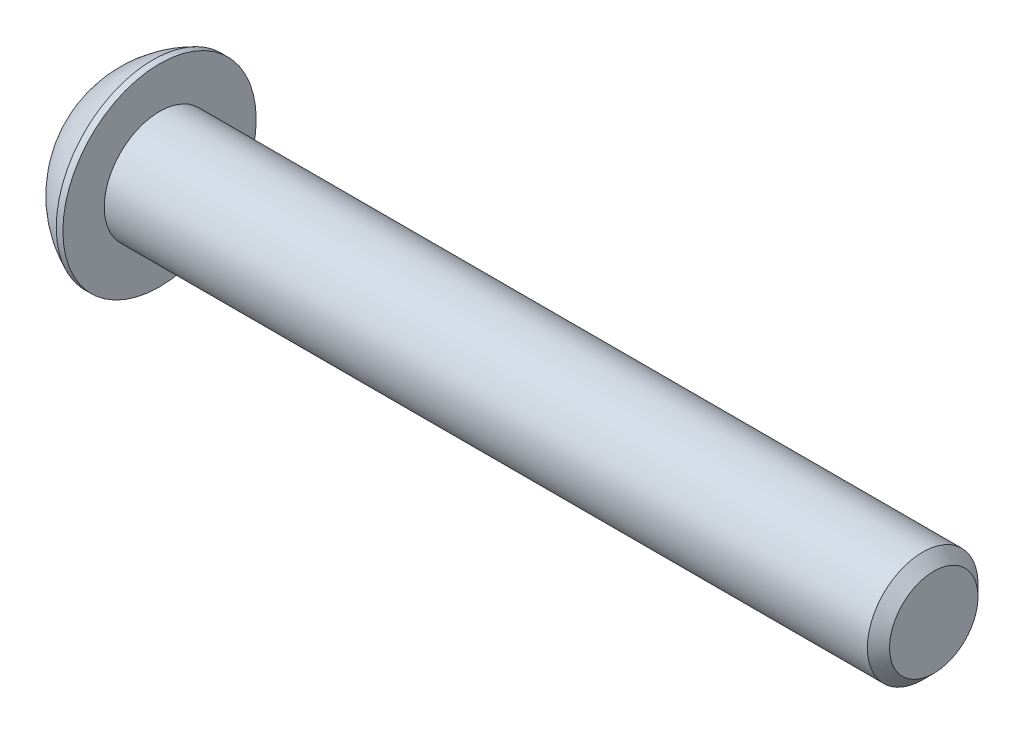
ISO-10303-21;
HEADER;
FILE_DESCRIPTION(('STEP AP214'),'2;1');
FILE_NAME('part.step','',(''),(''),'','','');
FILE_SCHEMA(('AUTOMOTIVE_DESIGN { 1 0 10303 214 1 1 1 1 }'));
ENDSEC;
DATA;
#1=APPLICATION_CONTEXT('core data for automotive mechanical design processes');
#2=APPLICATION_PROTOCOL_DEFINITION('international standard','automotive_design',2000,#1);
#3=PRODUCT_CONTEXT('',#1,'mechanical');
#4=PRODUCT('Part','Part','',(#3));
#5=PRODUCT_RELATED_PRODUCT_CATEGORY('part','',(#4));
#6=PRODUCT_DEFINITION_FORMATION('','',#4);
#7=PRODUCT_DEFINITION_CONTEXT('part definition',#1,'design');
#8=PRODUCT_DEFINITION('design','',#6,#7);
#9=PRODUCT_DEFINITION_SHAPE('','',#8);
#10=(LENGTH_UNIT() NAMED_UNIT(*) SI_UNIT(.MILLI.,.METRE.));
#11=(NAMED_UNIT(*) PLANE_ANGLE_UNIT() SI_UNIT($,.RADIAN.));
#12=(NAMED_UNIT(*) SI_UNIT($,.STERADIAN.) SOLID_ANGLE_UNIT());
#13=UNCERTAINTY_MEASURE_WITH_UNIT(LENGTH_MEASURE(1.E-05),#10,'distance_accuracy_value','');
#14=(GEOMETRIC_REPRESENTATION_CONTEXT(3) GLOBAL_UNCERTAINTY_ASSIGNED_CONTEXT((#13)) GLOBAL_UNIT_ASSIGNED_CONTEXT((#10,
#11,#12)) REPRESENTATION_CONTEXT('',''));
#15=CARTESIAN_POINT('',(0.,0.,0.));
#16=DIRECTION('',(0.,0.,1.));
#17=DIRECTION('',(1.,0.,0.));
#18=AXIS2_PLACEMENT_3D('',#15,#16,#17);
#19=CARTESIAN_POINT('',(1.32080000000045,0.,0.));
#20=DIRECTION('',(-1.,0.,0.));
#21=DIRECTION('',(0.,0.,1.));
#22=AXIS2_PLACEMENT_3D('',#19,#20,#21);
#23=CONICAL_SURFACE('',#22,1.1937999999998,1.04719755119615);
#24=CARTESIAN_POINT('',(2.01004075135902,0.,-4.44089209850063E-13));
#25=VERTEX_POINT('',#24);
#26=VERTEX_LOOP('',#25);
#27=FACE_BOUND('',#26,.T.);
#28=CARTESIAN_POINT('',(1.32080000000033,0.,0.));
#29=DIRECTION('',(-1.,0.,0.));
#30=DIRECTION('',(0.,0.,1.));
#31=AXIS2_PLACEMENT_3D('',#28,#29,#30);
#32=CIRCLE('',#31,1.19380000000002);
#33=CARTESIAN_POINT('',(1.32080000000033,0.,1.19380000000002));
#34=VERTEX_POINT('',#33);
#35=EDGE_CURVE('E20',#34,#34,#32,.T.);
#36=ORIENTED_EDGE('',*,*,#35,.T.);
#37=EDGE_LOOP('',(#36));
#38=FACE_BOUND('',#37,.T.);
#39=ADVANCED_FACE('F17',(#27,#38),#23,.F.);
#40=CARTESIAN_POINT('',(1.32080000000001,-2.29135888084632,0.));
#41=DIRECTION('',(1.,0.,0.));
#42=DIRECTION('',(0.,1.,0.));
#43=AXIS2_PLACEMENT_3D('',#40,#41,#42);
#44=PLANE('',#43);
#45=DIRECTION('',(0.,1.,0.));
#46=VECTOR('',#45,1.);
#47=CARTESIAN_POINT('',(1.32080000000001,-1.14567944042309,1.98437500000009));
#48=LINE('',#47,#46);
#49=CARTESIAN_POINT('',(1.32080000000001,1.14567944042324,1.98437500000009));
#50=VERTEX_POINT('',#49);
#51=CARTESIAN_POINT('',(1.32080000000001,-1.14567944042309,1.98437500000009));
#52=VERTEX_POINT('',#51);
#53=EDGE_CURVE('E69',#50,#52,#48,.F.);
#54=ORIENTED_EDGE('',*,*,#53,.F.);
#55=DIRECTION('',(0.,0.5,-0.866025403784439));
#56=VECTOR('',#55,1.);
#57=CARTESIAN_POINT('',(1.32080000000001,1.14567944042324,1.98437500000009));
#58=LINE('',#57,#56);
#59=CARTESIAN_POINT('',(1.32080000000001,2.29135888084636,0.));
#60=VERTEX_POINT('',#59);
#61=EDGE_CURVE('E190',#60,#50,#58,.F.);
#62=ORIENTED_EDGE('',*,*,#61,.F.);
#63=DIRECTION('',(0.,-0.500000000000003,-0.866025403784437));
#64=VECTOR('',#63,1.);
#65=CARTESIAN_POINT('',(1.32080000000001,2.29135888084635,0.));
#66=LINE('',#65,#64);
#67=CARTESIAN_POINT('',(1.32080000000001,1.14567944042318,-1.98437499999994));
#68=VERTEX_POINT('',#67);
#69=EDGE_CURVE('E194',#68,#60,#66,.F.);
#70=ORIENTED_EDGE('',*,*,#69,.F.);
#71=DIRECTION('',(0.,-1.,0.));
#72=VECTOR('',#71,1.);
#73=CARTESIAN_POINT('',(1.32080000000001,1.14567944042318,-1.98437499999994));
#74=LINE('',#73,#72);
#75=CARTESIAN_POINT('',(1.32080000000001,-1.14567944042316,-1.98437499999991));
#76=VERTEX_POINT('',#75);
#77=EDGE_CURVE('E199',#76,#68,#74,.F.);
#78=ORIENTED_EDGE('',*,*,#77,.F.);
#79=DIRECTION('',(0.,-0.500000000000001,0.866025403784438));
#80=VECTOR('',#79,1.);
#81=CARTESIAN_POINT('',(1.32080000000001,-1.14567944042317,-1.9843749999999));
#82=LINE('',#81,#80);
#83=CARTESIAN_POINT('',(1.32080000000001,-2.29135888084632,0.));
#84=VERTEX_POINT('',#83);
#85=EDGE_CURVE('E204',#84,#76,#82,.F.);
#86=ORIENTED_EDGE('',*,*,#85,.F.);
#87=DIRECTION('',(0.,0.500000000000003,0.866025403784437));
#88=VECTOR('',#87,1.);
#89=CARTESIAN_POINT('',(1.32080000000001,-2.29135888084632,0.));
#90=LINE('',#89,#88);
#91=EDGE_CURVE('E82',#52,#84,#90,.F.);
#92=ORIENTED_EDGE('',*,*,#91,.F.);
#93=EDGE_LOOP('',(#54,#62,#70,#78,#86,#92));
#94=FACE_BOUND('',#93,.T.);
#95=ORIENTED_EDGE('',*,*,#35,.F.);
#96=EDGE_LOOP('',(#95));
#97=FACE_BOUND('',#96,.T.);
#98=ADVANCED_FACE('F75',(#94,#97),#44,.F.);
#99=CARTESIAN_POINT('',(1.32080000000001,-1.14567944042309,1.98437500000009));
#100=DIRECTION('',(0.,0.,-1.));
#101=DIRECTION('',(0.,1.,0.));
#102=AXIS2_PLACEMENT_3D('',#99,#100,#101);
#103=PLANE('',#102);
#104=ORIENTED_EDGE('',*,*,#53,.T.);
#105=DIRECTION('',(1.,0.,0.));
#106=VECTOR('',#105,1.);
#107=CARTESIAN_POINT('',(1.32080000000001,-1.14567944042311,1.98437500000011));
#108=LINE('',#107,#106);
#109=CARTESIAN_POINT('',(0.,-1.14567944042309,1.98437500000009));
#110=VERTEX_POINT('',#109);
#111=EDGE_CURVE('E79',#110,#52,#108,.T.);
#112=ORIENTED_EDGE('',*,*,#111,.F.);
#113=DIRECTION('',(0.,-1.,0.));
#114=VECTOR('',#113,1.);
#115=CARTESIAN_POINT('',(0.,0.,1.98437500000009));
#116=LINE('',#115,#114);
#117=CARTESIAN_POINT('',(0.,1.14567944042324,1.98437500000009));
#118=VERTEX_POINT('',#117);
#119=EDGE_CURVE('E184',#118,#110,#116,.T.);
#120=ORIENTED_EDGE('',*,*,#119,.F.);
#121=DIRECTION('',(1.,0.,0.));
#122=VECTOR('',#121,1.);
#123=CARTESIAN_POINT('',(1.32080000000001,1.14567944042324,1.98437500000009));
#124=LINE('',#123,#122);
#125=EDGE_CURVE('E187',#50,#118,#124,.F.);
#126=ORIENTED_EDGE('',*,*,#125,.F.);
#127=EDGE_LOOP('',(#104,#112,#120,#126));
#128=FACE_BOUND('',#127,.T.);
#129=ADVANCED_FACE('F129',(#128),#103,.T.);
#130=CARTESIAN_POINT('',(1.32080000000001,-2.29135888084632,0.));
#131=DIRECTION('',(0.,0.866025403784437,-0.500000000000003));
#132=DIRECTION('',(0.,0.500000000000003,0.866025403784437));
#133=AXIS2_PLACEMENT_3D('',#130,#131,#132);
#134=PLANE('',#133);
#135=ORIENTED_EDGE('',*,*,#91,.T.);
#136=DIRECTION('',(1.,0.,0.));
#137=VECTOR('',#136,1.);
#138=CARTESIAN_POINT('',(1.32080000000001,-2.29135888084631,0.));
#139=LINE('',#138,#137);
#140=CARTESIAN_POINT('',(0.,-2.29135888084632,0.));
#141=VERTEX_POINT('',#140);
#142=EDGE_CURVE('E206',#141,#84,#139,.T.);
#143=ORIENTED_EDGE('',*,*,#142,.F.);
#144=DIRECTION('',(0.,-0.500000000000024,-0.866025403784425));
#145=VECTOR('',#144,1.);
#146=CARTESIAN_POINT('',(0.,-1.14567944042307,1.98437500000008));
#147=LINE('',#146,#145);
#148=EDGE_CURVE('E181',#110,#141,#147,.T.);
#149=ORIENTED_EDGE('',*,*,#148,.F.);
#150=ORIENTED_EDGE('',*,*,#111,.T.);
#151=EDGE_LOOP('',(#135,#143,#149,#150));
#152=FACE_BOUND('',#151,.T.);
#153=ADVANCED_FACE('F125',(#152),#134,.T.);
#154=CARTESIAN_POINT('',(1.32080000000001,-1.14567944042317,-1.9843749999999));
#155=DIRECTION('',(0.,0.866025403784438,0.500000000000001));
#156=DIRECTION('',(0.,-0.500000000000001,0.866025403784438));
#157=AXIS2_PLACEMENT_3D('',#154,#155,#156);
#158=PLANE('',#157);
#159=ORIENTED_EDGE('',*,*,#85,.T.);
#160=DIRECTION('',(1.,0.,0.));
#161=VECTOR('',#160,1.);
#162=CARTESIAN_POINT('',(1.32080000000001,-1.14567944042315,-1.98437499999994));
#163=LINE('',#162,#161);
#164=CARTESIAN_POINT('',(0.,-1.14567944042316,-1.98437499999992));
#165=VERTEX_POINT('',#164);
#166=EDGE_CURVE('E201',#165,#76,#163,.T.);
#167=ORIENTED_EDGE('',*,*,#166,.F.);
#168=DIRECTION('',(0.,0.500000000000004,-0.866025403784436));
#169=VECTOR('',#168,1.);
#170=CARTESIAN_POINT('',(0.,-2.29135888084632,0.));
#171=LINE('',#170,#169);
#172=EDGE_CURVE('E178',#141,#165,#171,.T.);
#173=ORIENTED_EDGE('',*,*,#172,.F.);
#174=ORIENTED_EDGE('',*,*,#142,.T.);
#175=EDGE_LOOP('',(#159,#167,#173,#174));
#176=FACE_BOUND('',#175,.T.);
#177=ADVANCED_FACE('F121',(#176),#158,.T.);
#178=CARTESIAN_POINT('',(1.32080000000001,1.14567944042318,-1.98437499999994));
#179=DIRECTION('',(0.,0.,1.));
#180=DIRECTION('',(0.,-1.,0.));
#181=AXIS2_PLACEMENT_3D('',#178,#179,#180);
#182=PLANE('',#181);
#183=ORIENTED_EDGE('',*,*,#77,.T.);
#184=DIRECTION('',(1.,0.,0.));
#185=VECTOR('',#184,1.);
#186=CARTESIAN_POINT('',(1.32080000000001,1.14567944042317,-1.984375));
#187=LINE('',#186,#185);
#188=CARTESIAN_POINT('',(0.,1.14567944042318,-1.98437499999995));
#189=VERTEX_POINT('',#188);
#190=EDGE_CURVE('E196',#189,#68,#187,.T.);
#191=ORIENTED_EDGE('',*,*,#190,.F.);
#192=DIRECTION('',(0.,-1.,0.));
#193=VECTOR('',#192,1.);
#194=CARTESIAN_POINT('',(0.,0.,-1.98437499999993));
#195=LINE('',#194,#193);
#196=EDGE_CURVE('E175',#165,#189,#195,.F.);
#197=ORIENTED_EDGE('',*,*,#196,.F.);
#198=ORIENTED_EDGE('',*,*,#166,.T.);
#199=EDGE_LOOP('',(#183,#191,#197,#198));
#200=FACE_BOUND('',#199,.T.);
#201=ADVANCED_FACE('F118',(#200),#182,.T.);
#202=CARTESIAN_POINT('',(1.32080000000001,2.29135888084635,0.));
#203=DIRECTION('',(0.,-0.866025403784437,0.500000000000003));
#204=DIRECTION('',(0.,-0.500000000000003,-0.866025403784437));
#205=AXIS2_PLACEMENT_3D('',#202,#203,#204);
#206=PLANE('',#205);
#207=ORIENTED_EDGE('',*,*,#69,.T.);
#208=DIRECTION('',(1.,0.,0.));
#209=VECTOR('',#208,1.);
#210=CARTESIAN_POINT('',(1.32080000000001,2.29135888084642,0.));
#211=LINE('',#210,#209);
#212=CARTESIAN_POINT('',(0.,2.29135888084636,0.));
#213=VERTEX_POINT('',#212);
#214=EDGE_CURVE('E35',#213,#60,#211,.T.);
#215=ORIENTED_EDGE('',*,*,#214,.F.);
#216=DIRECTION('',(0.,0.500000000000003,0.866025403784437));
#217=VECTOR('',#216,1.);
#218=CARTESIAN_POINT('',(0.,1.14567944042317,-1.984375));
#219=LINE('',#218,#217);
#220=EDGE_CURVE('E172',#189,#213,#219,.T.);
#221=ORIENTED_EDGE('',*,*,#220,.F.);
#222=ORIENTED_EDGE('',*,*,#190,.T.);
#223=EDGE_LOOP('',(#207,#215,#221,#222));
#224=FACE_BOUND('',#223,.T.);
#225=ADVANCED_FACE('F114',(#224),#206,.T.);
#226=CARTESIAN_POINT('',(1.32080000000001,1.14567944042324,1.98437500000009));
#227=DIRECTION('',(0.,-0.866025403784439,-0.5));
#228=DIRECTION('',(0.,0.5,-0.866025403784439));
#229=AXIS2_PLACEMENT_3D('',#226,#227,#228);
#230=PLANE('',#229);
#231=ORIENTED_EDGE('',*,*,#61,.T.);
#232=ORIENTED_EDGE('',*,*,#125,.T.);
#233=DIRECTION('',(0.,-0.499999999999968,0.866025403784457));
#234=VECTOR('',#233,1.);
#235=CARTESIAN_POINT('',(0.,2.29135888084635,0.));
#236=LINE('',#235,#234);
#237=EDGE_CURVE('E101',#213,#118,#236,.T.);
#238=ORIENTED_EDGE('',*,*,#237,.F.);
#239=ORIENTED_EDGE('',*,*,#214,.T.);
#240=EDGE_LOOP('',(#231,#232,#238,#239));
#241=FACE_BOUND('',#240,.T.);
#242=ADVANCED_FACE('F110',(#241),#230,.T.);
#243=CARTESIAN_POINT('',(0.,0.,0.));
#244=DIRECTION('',(-1.,0.,0.));
#245=DIRECTION('',(0.,-1.,0.));
#246=AXIS2_PLACEMENT_3D('',#243,#244,#245);
#247=PLANE('',#246);
#248=ORIENTED_EDGE('',*,*,#220,.T.);
#249=ORIENTED_EDGE('',*,*,#237,.T.);
#250=ORIENTED_EDGE('',*,*,#119,.T.);
#251=ORIENTED_EDGE('',*,*,#148,.T.);
#252=ORIENTED_EDGE('',*,*,#172,.T.);
#253=ORIENTED_EDGE('',*,*,#196,.T.);
#254=EDGE_LOOP('',(#248,#249,#250,#251,#252,#253));
#255=FACE_BOUND('',#254,.T.);
#256=CARTESIAN_POINT('',(0.,2.77495000000004,0.));
#257=CARTESIAN_POINT('',(0.,2.77494953309951,0.077911893752265));
#258=CARTESIAN_POINT('',(0.,2.77166578388029,0.155838105919689));
#259=CARTESIAN_POINT('',(0.,2.75855213600209,0.311152012455823));
#260=CARTESIAN_POINT('',(0.,2.74872030471471,0.388539541019475));
#261=CARTESIAN_POINT('',(0.,2.72255472645681,0.542341518735636));
#262=CARTESIAN_POINT('',(-2.70994793820671E-13,2.70621065843667,0.618754223567496));
#263=CARTESIAN_POINT('',(2.71215166270345E-13,2.66713326915781,0.769973634285941));
#264=CARTESIAN_POINT('',(1.01269126320733E-12,2.64439476297873,0.8447789836462));
#265=CARTESIAN_POINT('',(1.81921584447808E-12,2.56690195943355,1.06566239301784));
#266=CARTESIAN_POINT('',(4.76637279005743E-13,2.50280672569933,1.20857954243979));
#267=CARTESIAN_POINT('',(-4.76655399922673E-13,2.35149826934101,1.4816087456153));
#268=CARTESIAN_POINT('',(0.,2.264284167904,1.6117203123349));
#269=CARTESIAN_POINT('',(0.,2.11810939288344,1.79445660654259));
#270=CARTESIAN_POINT('',(0.,2.0667869379163,1.85333128513988));
#271=CARTESIAN_POINT('',(0.,1.95940522984453,1.96650727912783));
#272=CARTESIAN_POINT('',(0.,1.90335059143539,2.02081294920036));
#273=CARTESIAN_POINT('',(0.,1.78683891013966,2.12453280878573));
#274=CARTESIAN_POINT('',(0.,1.72637988450325,2.17394477135531));
#275=CARTESIAN_POINT('',(0.,1.60151968865714,2.26750481692899));
#276=CARTESIAN_POINT('',(0.,1.53711760864541,2.31165167810839));
#277=CARTESIAN_POINT('',(0.,1.33869902291635,2.43567242603936));
#278=CARTESIAN_POINT('',(0.,1.19934704110699,2.50723588662792));
#279=CARTESIAN_POINT('',(0.,0.910681609121916,2.62590828672813));
#280=CARTESIAN_POINT('',(0.,0.761368265357432,2.6730174874227));
#281=CARTESIAN_POINT('',(0.,0.456932649466656,2.74151230663998));
#282=CARTESIAN_POINT('',(0.,0.301810346322617,2.76289778778712));
#283=CARTESIAN_POINT('',(0.,-0.00982263870891821,2.77931595661147));
#284=CARTESIAN_POINT('',(0.,-0.166333320596415,2.77434864428868));
#285=CARTESIAN_POINT('',(0.,-0.476280836814418,2.73822217653064));
#286=CARTESIAN_POINT('',(0.,-0.629717687555952,2.70706316096972));
#287=CARTESIAN_POINT('',(0.,-0.929254830044241,2.6193798077114));
#288=CARTESIAN_POINT('',(0.,-1.07535504341316,2.56285519909559));
#289=CARTESIAN_POINT('',(0.,-1.28570692598576,2.46037024128099));
#290=CARTESIAN_POINT('',(0.,-1.35439130022283,2.42323494812886));
#291=CARTESIAN_POINT('',(0.,-1.48839128719896,2.34331277270246));
#292=CARTESIAN_POINT('',(0.,-1.55370767631784,2.30052720108822));
#293=CARTESIAN_POINT('',(0.,-1.68047292776591,2.20962421887045));
#294=CARTESIAN_POINT('',(0.,-1.74192352786817,2.16150923122339));
#295=CARTESIAN_POINT('',(0.,-1.86060297067988,2.06024311301273));
#296=CARTESIAN_POINT('',(0.,-1.91782768181712,2.00708716697621));
#297=CARTESIAN_POINT('',(0.,-2.08239462196648,1.84072208565531));
#298=CARTESIAN_POINT('',(0.,-2.18279764272598,1.72049499758412));
#299=CARTESIAN_POINT('',(0.,-2.3619575494406,1.46487629213008));
#300=CARTESIAN_POINT('',(0.,-2.44071525816753,1.32948525142797));
#301=CARTESIAN_POINT('',(0.,-2.5409888269527,1.11796734074385));
#302=CARTESIAN_POINT('',(0.,-2.57146177392723,1.04596540008337));
#303=CARTESIAN_POINT('',(0.,-2.62621251108995,0.899689259475667));
#304=CARTESIAN_POINT('',(0.,-2.6504953149556,0.825416953360854));
#305=CARTESIAN_POINT('',(0.,-2.69267708798763,0.675215808695108));
#306=CARTESIAN_POINT('',(0.,-2.71058613777933,0.599289789312993));
#307=CARTESIAN_POINT('',(0.,-2.73994710360123,0.446213628496834));
#308=CARTESIAN_POINT('',(0.,-2.75140092413867,0.36906385502469));
#309=CARTESIAN_POINT('',(0.,-2.76470470685519,0.243162088173333));
#310=CARTESIAN_POINT('',(0.,-2.76854547596614,0.194611672428479));
#311=CARTESIAN_POINT('',(0.,-2.7736682684326,0.0973760351838824));
#312=CARTESIAN_POINT('',(0.,-2.7749502917881,0.0486908136841404));
#313=CARTESIAN_POINT('',(0.,-2.77494953309943,-0.0779118937524467));
#314=CARTESIAN_POINT('',(0.,-2.77166578388021,-0.155838105919871));
#315=CARTESIAN_POINT('',(0.,-2.758552136002,-0.311152012456005));
#316=CARTESIAN_POINT('',(0.,-2.74872030471463,-0.388539541019658));
#317=CARTESIAN_POINT('',(0.,-2.72255472645672,-0.542341518735819));
#318=CARTESIAN_POINT('',(-2.70986635185437E-13,-2.70621065843658,-0.618754223567679));
#319=CARTESIAN_POINT('',(2.71207001000523E-13,-2.66713326915773,-0.769973634286124));
#320=CARTESIAN_POINT('',(1.01268841923123E-12,-2.64439476297865,-0.844778983646384));
#321=CARTESIAN_POINT('',(1.81922151887338E-12,-2.56690195943347,-1.06566239301802));
#322=CARTESIAN_POINT('',(4.7663876570586E-13,-2.50280672569924,-1.20857954243998));
#323=CARTESIAN_POINT('',(-4.76656886679312E-13,-2.35149826934092,-1.48160874561548));
#324=CARTESIAN_POINT('',(0.,-2.26428416790392,-1.61172031233509));
#325=CARTESIAN_POINT('',(0.,-2.11810939288336,-1.79445660654278));
#326=CARTESIAN_POINT('',(0.,-2.06678693791622,-1.85333128514006));
#327=CARTESIAN_POINT('',(0.,-1.95940522984444,-1.96650727912802));
#328=CARTESIAN_POINT('',(0.,-1.9033505914353,-2.02081294920054));
#329=CARTESIAN_POINT('',(0.,-1.78683891013958,-2.12453280878591));
#330=CARTESIAN_POINT('',(0.,-1.72637988450317,-2.1739447713555));
#331=CARTESIAN_POINT('',(0.,-1.60151968865706,-2.26750481692918));
#332=CARTESIAN_POINT('',(0.,-1.53711760864532,-2.31165167810857));
#333=CARTESIAN_POINT('',(0.,-1.33869902291627,-2.43567242603954));
#334=CARTESIAN_POINT('',(0.,-1.1993470411069,-2.5072358866281));
#335=CARTESIAN_POINT('',(0.,-0.910681609121828,-2.62590828672831));
#336=CARTESIAN_POINT('',(0.,-0.761368265357345,-2.67301748742288));
#337=CARTESIAN_POINT('',(0.,-0.45693264946657,-2.74151230664016));
#338=CARTESIAN_POINT('',(0.,-0.301810346322531,-2.7628977877873));
#339=CARTESIAN_POINT('',(0.,0.00982263870900505,-2.77931595661164));
#340=CARTESIAN_POINT('',(0.,0.166333320596502,-2.77434864428886));
#341=CARTESIAN_POINT('',(0.,0.476280836814504,-2.73822217653082));
#342=CARTESIAN_POINT('',(0.,0.629717687556037,-2.7070631609699));
#343=CARTESIAN_POINT('',(0.,0.929254830044326,-2.61937980771158));
#344=CARTESIAN_POINT('',(0.,1.07535504341325,-2.56285519909577));
#345=CARTESIAN_POINT('',(0.,1.28570692598584,-2.46037024128117));
#346=CARTESIAN_POINT('',(0.,1.35439130022292,-2.42323494812904));
#347=CARTESIAN_POINT('',(0.,1.48839128719905,-2.34331277270264));
#348=CARTESIAN_POINT('',(0.,1.55370767631792,-2.3005272010884));
#349=CARTESIAN_POINT('',(0.,1.680472927766,-2.20962421887063));
#350=CARTESIAN_POINT('',(0.,1.74192352786826,-2.16150923122357));
#351=CARTESIAN_POINT('',(0.,1.86060297067997,-2.06024311301291));
#352=CARTESIAN_POINT('',(0.,1.91782768181721,-2.00708716697639));
#353=CARTESIAN_POINT('',(0.,2.08239462196656,-1.84072208565548));
#354=CARTESIAN_POINT('',(0.,2.18279764272606,-1.7204949975843));
#355=CARTESIAN_POINT('',(0.,2.36195754944068,-1.46487629213026));
#356=CARTESIAN_POINT('',(0.,2.44071525816762,-1.32948525142815));
#357=CARTESIAN_POINT('',(0.,2.54098882695278,-1.11796734074403));
#358=CARTESIAN_POINT('',(0.,2.57146177392732,-1.04596540008355));
#359=CARTESIAN_POINT('',(0.,2.62621251109003,-0.899689259475846));
#360=CARTESIAN_POINT('',(0.,2.65049531495568,-0.825416953361034));
#361=CARTESIAN_POINT('',(0.,2.69267708798771,-0.675215808695288));
#362=CARTESIAN_POINT('',(0.,2.71058613777941,-0.599289789313172));
#363=CARTESIAN_POINT('',(0.,2.73994710360131,-0.446213628497012));
#364=CARTESIAN_POINT('',(0.,2.75140092413875,-0.369063855024868));
#365=CARTESIAN_POINT('',(0.,2.76470470685527,-0.243162088173511));
#366=CARTESIAN_POINT('',(0.,2.76854547596622,-0.194611672428657));
#367=CARTESIAN_POINT('',(0.,2.77366826843268,-0.0973760351840628));
#368=CARTESIAN_POINT('',(0.,2.77495029178818,-0.0486908136843215));
#369=CARTESIAN_POINT('',(0.,2.77495000000004,0.));
#370=B_SPLINE_CURVE_WITH_KNOTS('',3,(#256,#257,#258,#259,#260,#261,#262,#263,#264,#265,#266,
#267,#268,#269,#270,#271,#272,#273,#274,#275,#276,#277,#278,#279,#280,#281,#282,#283,#284,#285,
#286,#287,#288,#289,#290,#291,#292,#293,#294,#295,#296,#297,#298,#299,#300,#301,#302,#303,#304,
#305,#306,#307,#308,#309,#310,#311,#312,#313,#314,#315,#316,#317,#318,#319,#320,#321,#322,#323,
#324,#325,#326,#327,#328,#329,#330,#331,#332,#333,#334,#335,#336,#337,#338,#339,#340,#341,#342,
#343,#344,#345,#346,#347,#348,#349,#350,#351,#352,#353,#354,#355,#356,#357,#358,#359,#360,#361,
#362,#363,#364,#365,#366,#367,#368,#369),.UNSPECIFIED.,.T.,.F.,(4,2,2,2,2,2,2,2,2,2,2,2,2,2,2,2,
2,2,2,2,2,2,2,2,2,2,2,2,2,2,2,2,2,2,2,2,2,2,2,2,2,2,2,2,2,2,2,2,2,2,2,2,2,2,2,2,4),(0.,
0.233690856748163,0.467450716578751,0.701582538521471,0.935904756015414,1.40343220467667,
1.87097742791502,2.10505636898837,2.33890962270652,2.57286880998746,2.80688218486306,
3.27442101763127,3.74195485676357,4.20949119271389,4.67702752866417,5.14456136779641,
5.61210020056469,5.84611357544034,6.08007276272136,6.31392601643949,6.54800495751273,
7.01555018075072,7.48307762941212,7.71739984690652,7.95153166884955,8.18529152868023,
8.41898238542855,8.56502681353347,8.71107124163843,8.94476209838659,9.17852195821718,
9.4126537801599,9.64697599765385,10.1145034463151,10.5820486695535,10.8161276106268,
11.0499808643449,11.2839400516259,11.5179534265015,11.9854922592697,12.453026098402,
12.9205624343523,13.3880987703026,13.8556326094348,14.3231714422031,14.5571848170788,
14.7911440043598,15.0249972580779,15.2590761991512,15.7266214223891,16.1941488710506,
16.428471088545,16.662602910488,16.8963627703187,17.130053627067,17.2760980551719,
17.4221424832769),.UNSPECIFIED.);
#371=CARTESIAN_POINT('',(0.,2.77495000000004,0.));
#372=VERTEX_POINT('',#371);
#373=EDGE_CURVE('E94',#372,#372,#370,.T.);
#374=ORIENTED_EDGE('',*,*,#373,.F.);
#375=EDGE_LOOP('',(#374));
#376=FACE_BOUND('',#375,.T.);
#377=ADVANCED_FACE('F106',(#255,#376),#247,.T.);
#378=CARTESIAN_POINT('',(5.37260881410256,0.,0.));
#379=DIRECTION('',(0.,1.,0.));
#380=DIRECTION('',(1.,0.,0.));
#381=AXIS2_PLACEMENT_3D('',#378,#379,#380);
#382=SPHERICAL_SURFACE('',#381,6.04692260342999);
#383=CARTESIAN_POINT('',(2.9718,0.,0.));
#384=DIRECTION('',(-1.,0.,0.));
#385=DIRECTION('',(0.,-1.,0.));
#386=AXIS2_PLACEMENT_3D('',#383,#384,#385);
#387=CIRCLE('',#386,5.5499);
#388=CARTESIAN_POINT('',(2.9718,-5.5499,0.));
#389=VERTEX_POINT('',#388);
#390=EDGE_CURVE('E92',#389,#389,#387,.F.);
#391=ORIENTED_EDGE('',*,*,#390,.F.);
#392=EDGE_LOOP('',(#391));
#393=FACE_BOUND('',#392,.T.);
#394=ORIENTED_EDGE('',*,*,#373,.T.);
#395=EDGE_LOOP('',(#394));
#396=FACE_BOUND('',#395,.T.);
#397=ADVANCED_FACE('F102',(#393,#396),#382,.T.);
#398=CARTESIAN_POINT('',(47.8028000000002,0.,0.));
#399=DIRECTION('',(-1.,0.,0.));
#400=DIRECTION('',(0.,-1.,0.));
#401=AXIS2_PLACEMENT_3D('',#398,#399,#400);
#402=PLANE('',#401);
#403=CARTESIAN_POINT('',(47.8028000000563,0.,0.));
#404=DIRECTION('',(-1.,0.,0.));
#405=DIRECTION('',(0.,0.,1.));
#406=AXIS2_PLACEMENT_3D('',#403,#404,#405);
#407=CIRCLE('',#406,2.54000000006723);
#408=CARTESIAN_POINT('',(47.8028000000563,0.,2.54000000006727));
#409=VERTEX_POINT('',#408);
#410=EDGE_CURVE('E89',#409,#409,#407,.T.);
#411=ORIENTED_EDGE('',*,*,#410,.F.);
#412=EDGE_LOOP('',(#411));
#413=FACE_BOUND('',#412,.T.);
#414=ADVANCED_FACE('F156',(#413),#402,.F.);
#415=CARTESIAN_POINT('',(0.,0.,0.));
#416=DIRECTION('',(-1.,0.,0.));
#417=DIRECTION('',(0.,-1.,0.));
#418=AXIS2_PLACEMENT_3D('',#415,#416,#417);
#419=CYLINDRICAL_SURFACE('',#418,5.5499);
#420=ORIENTED_EDGE('',*,*,#390,.T.);
#421=EDGE_LOOP('',(#420));
#422=FACE_BOUND('',#421,.T.);
#423=CARTESIAN_POINT('',(3.35279999999999,0.,0.));
#424=DIRECTION('',(-1.,0.,0.));
#425=DIRECTION('',(0.,-1.,0.));
#426=AXIS2_PLACEMENT_3D('',#423,#424,#425);
#427=CIRCLE('',#426,5.5499);
#428=CARTESIAN_POINT('',(3.35279999999999,-5.5499,0.));
#429=VERTEX_POINT('',#428);
#430=EDGE_CURVE('E86',#429,#429,#427,.T.);
#431=ORIENTED_EDGE('',*,*,#430,.T.);
#432=EDGE_LOOP('',(#431));
#433=FACE_BOUND('',#432,.T.);
#434=ADVANCED_FACE('F153',(#422,#433),#419,.T.);
#435=CARTESIAN_POINT('',(47.1678000000679,0.,0.));
#436=DIRECTION('',(-1.,0.,0.));
#437=DIRECTION('',(0.,0.,1.));
#438=AXIS2_PLACEMENT_3D('',#435,#436,#437);
#439=CONICAL_SURFACE('',#438,3.17499999999878,0.78539816335269);
#440=ORIENTED_EDGE('',*,*,#410,.T.);
#441=EDGE_LOOP('',(#440));
#442=FACE_BOUND('',#441,.T.);
#443=CARTESIAN_POINT('',(47.1678000000002,0.,0.));
#444=DIRECTION('',(-1.,0.,0.));
#445=DIRECTION('',(0.,-1.,0.));
#446=AXIS2_PLACEMENT_3D('',#443,#444,#445);
#447=CIRCLE('',#446,3.175);
#448=CARTESIAN_POINT('',(47.1678000000002,-3.175,0.));
#449=VERTEX_POINT('',#448);
#450=EDGE_CURVE('E26',#449,#449,#447,.T.);
#451=ORIENTED_EDGE('',*,*,#450,.F.);
#452=EDGE_LOOP('',(#451));
#453=FACE_BOUND('',#452,.T.);
#454=ADVANCED_FACE('F145',(#442,#453),#439,.T.);
#455=CARTESIAN_POINT('',(3.35279999999999,3.17500000000003,-1.11022302462516E-13));
#456=DIRECTION('',(-1.,0.,0.));
#457=DIRECTION('',(0.,-1.,0.));
#458=AXIS2_PLACEMENT_3D('',#455,#456,#457);
#459=PLANE('',#458);
#460=CARTESIAN_POINT('',(3.35279999999999,0.,0.));
#461=DIRECTION('',(-1.,0.,0.));
#462=DIRECTION('',(0.,-1.,0.));
#463=AXIS2_PLACEMENT_3D('',#460,#461,#462);
#464=CIRCLE('',#463,3.175);
#465=CARTESIAN_POINT('',(3.35279999999999,-3.175,0.));
#466=VERTEX_POINT('',#465);
#467=EDGE_CURVE('E11',#466,#466,#464,.F.);
#468=ORIENTED_EDGE('',*,*,#467,.F.);
#469=EDGE_LOOP('',(#468));
#470=FACE_BOUND('',#469,.T.);
#471=ORIENTED_EDGE('',*,*,#430,.F.);
#472=EDGE_LOOP('',(#471));
#473=FACE_BOUND('',#472,.T.);
#474=ADVANCED_FACE('F139',(#470,#473),#459,.F.);
#475=CARTESIAN_POINT('',(0.,0.,0.));
#476=DIRECTION('',(-1.,0.,0.));
#477=DIRECTION('',(0.,-1.,0.));
#478=AXIS2_PLACEMENT_3D('',#475,#476,#477);
#479=CYLINDRICAL_SURFACE('',#478,3.175);
#480=ORIENTED_EDGE('',*,*,#450,.T.);
#481=EDGE_LOOP('',(#480));
#482=FACE_BOUND('',#481,.T.);
#483=ORIENTED_EDGE('',*,*,#467,.T.);
#484=EDGE_LOOP('',(#483));
#485=FACE_BOUND('',#484,.T.);
#486=ADVANCED_FACE('F137',(#482,#485),#479,.T.);
#487=CLOSED_SHELL('',(#39,#98,#129,#153,#177,#201,#225,#242,#377,#397,#414,#434,#454,#474,#486));
#488=MANIFOLD_SOLID_BREP('B1',#487);
#489=ADVANCED_BREP_SHAPE_REPRESENTATION('',(#18,#488),#14);
#490=SHAPE_DEFINITION_REPRESENTATION(#9,#489);
ENDSEC;
END-ISO-10303-21;
